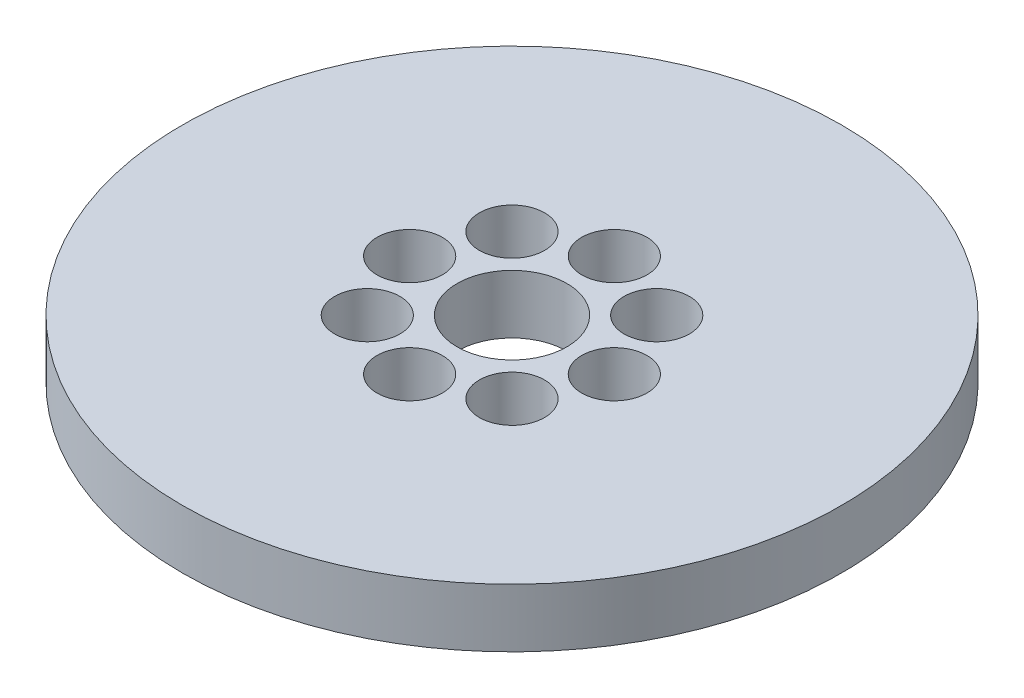
ISO-10303-21;
HEADER;
FILE_DESCRIPTION(('STEP AP214'),'2;1');
FILE_NAME('part.step','',(''),(''),'','','');
FILE_SCHEMA(('AUTOMOTIVE_DESIGN { 1 0 10303 214 1 1 1 1 }'));
ENDSEC;
DATA;
#1=APPLICATION_CONTEXT('core data for automotive mechanical design processes');
#2=APPLICATION_PROTOCOL_DEFINITION('international standard','automotive_design',2000,#1);
#3=PRODUCT_CONTEXT('',#1,'mechanical');
#4=PRODUCT('Part','Part','',(#3));
#5=PRODUCT_RELATED_PRODUCT_CATEGORY('part','',(#4));
#6=PRODUCT_DEFINITION_FORMATION('','',#4);
#7=PRODUCT_DEFINITION_CONTEXT('part definition',#1,'design');
#8=PRODUCT_DEFINITION('design','',#6,#7);
#9=PRODUCT_DEFINITION_SHAPE('','',#8);
#10=(LENGTH_UNIT() NAMED_UNIT(*) SI_UNIT(.MILLI.,.METRE.));
#11=(NAMED_UNIT(*) PLANE_ANGLE_UNIT() SI_UNIT($,.RADIAN.));
#12=(NAMED_UNIT(*) SI_UNIT($,.STERADIAN.) SOLID_ANGLE_UNIT());
#13=UNCERTAINTY_MEASURE_WITH_UNIT(LENGTH_MEASURE(1.E-05),#10,'distance_accuracy_value','');
#14=(GEOMETRIC_REPRESENTATION_CONTEXT(3) GLOBAL_UNCERTAINTY_ASSIGNED_CONTEXT((#13)) GLOBAL_UNIT_ASSIGNED_CONTEXT((#10,
#11,#12)) REPRESENTATION_CONTEXT('',''));
#15=CARTESIAN_POINT('',(0.,0.,0.));
#16=DIRECTION('',(0.,0.,1.));
#17=DIRECTION('',(1.,0.,0.));
#18=AXIS2_PLACEMENT_3D('',#15,#16,#17);
#19=CARTESIAN_POINT('',(0.,8.,0.));
#20=DIRECTION('',(0.,-1.,0.));
#21=DIRECTION('',(0.,0.,-1.));
#22=AXIS2_PLACEMENT_3D('',#19,#20,#21);
#23=CYLINDRICAL_SURFACE('',#22,45.);
#24=CARTESIAN_POINT('',(0.,8.,0.));
#25=DIRECTION('',(0.,1.,0.));
#26=DIRECTION('',(0.,0.,1.));
#27=AXIS2_PLACEMENT_3D('',#24,#25,#26);
#28=CIRCLE('',#27,45.);
#29=CARTESIAN_POINT('',(0.,8.,45.));
#30=VERTEX_POINT('',#29);
#31=EDGE_CURVE('E10',#30,#30,#28,.T.);
#32=ORIENTED_EDGE('',*,*,#31,.F.);
#33=EDGE_LOOP('',(#32));
#34=FACE_BOUND('',#33,.T.);
#35=CARTESIAN_POINT('',(0.,0.,0.));
#36=DIRECTION('',(0.,1.,0.));
#37=DIRECTION('',(0.,0.,1.));
#38=AXIS2_PLACEMENT_3D('',#35,#36,#37);
#39=CIRCLE('',#38,45.);
#40=CARTESIAN_POINT('',(0.,0.,45.));
#41=VERTEX_POINT('',#40);
#42=EDGE_CURVE('E37',#41,#41,#39,.T.);
#43=ORIENTED_EDGE('',*,*,#42,.T.);
#44=EDGE_LOOP('',(#43));
#45=FACE_BOUND('',#44,.T.);
#46=ADVANCED_FACE('F40',(#34,#45),#23,.T.);
#47=CARTESIAN_POINT('',(0.,8.,0.));
#48=DIRECTION('',(0.,1.,0.));
#49=DIRECTION('',(0.,0.,1.));
#50=AXIS2_PLACEMENT_3D('',#47,#48,#49);
#51=PLANE('',#50);
#52=CARTESIAN_POINT('',(0.,8.,13.9738359424887));
#53=DIRECTION('',(0.,1.,0.));
#54=DIRECTION('',(1.,0.,0.));
#55=AXIS2_PLACEMENT_3D('',#52,#53,#54);
#56=CIRCLE('',#55,4.45452999199533);
#57=CARTESIAN_POINT('',(4.45452999199538,8.,13.9738359424887));
#58=VERTEX_POINT('',#57);
#59=EDGE_CURVE('E88',#58,#58,#56,.T.);
#60=ORIENTED_EDGE('',*,*,#59,.F.);
#61=EDGE_LOOP('',(#60));
#62=FACE_BOUND('',#61,.T.);
#63=CARTESIAN_POINT('',(9.88099415412215,8.,9.88099415412205));
#64=DIRECTION('',(0.,1.,0.));
#65=DIRECTION('',(0.707106781186544,0.,-0.707106781186551));
#66=AXIS2_PLACEMENT_3D('',#63,#64,#65);
#67=CIRCLE('',#66,4.45452999199533);
#68=CARTESIAN_POINT('',(13.0308225184609,8.,6.73116578978328));
#69=VERTEX_POINT('',#68);
#70=EDGE_CURVE('E79',#69,#69,#67,.T.);
#71=ORIENTED_EDGE('',*,*,#70,.F.);
#72=EDGE_LOOP('',(#71));
#73=FACE_BOUND('',#72,.T.);
#74=CARTESIAN_POINT('',(13.9738359424887,8.,0.));
#75=DIRECTION('',(0.,1.,0.));
#76=DIRECTION('',(0.,0.,-1.));
#77=AXIS2_PLACEMENT_3D('',#74,#75,#76);
#78=CIRCLE('',#77,4.45452999199533);
#79=CARTESIAN_POINT('',(13.9738359424887,8.,-4.45452999199533));
#80=VERTEX_POINT('',#79);
#81=EDGE_CURVE('E74',#80,#80,#78,.T.);
#82=ORIENTED_EDGE('',*,*,#81,.F.);
#83=EDGE_LOOP('',(#82));
#84=FACE_BOUND('',#83,.T.);
#85=CARTESIAN_POINT('',(9.88099415412202,8.,-9.88099415412219));
#86=DIRECTION('',(0.,1.,0.));
#87=DIRECTION('',(-0.707106781186554,0.,-0.707106781186541));
#88=AXIS2_PLACEMENT_3D('',#85,#86,#87);
#89=CIRCLE('',#88,4.45452999199533);
#90=CARTESIAN_POINT('',(6.73116578978324,8.,-13.0308225184609));
#91=VERTEX_POINT('',#90);
#92=EDGE_CURVE('E70',#91,#91,#89,.T.);
#93=ORIENTED_EDGE('',*,*,#92,.F.);
#94=EDGE_LOOP('',(#93));
#95=FACE_BOUND('',#94,.T.);
#96=CARTESIAN_POINT('',(-1.46368162275765E-13,8.,-13.9738359424887));
#97=DIRECTION('',(0.,1.,0.));
#98=DIRECTION('',(-1.,0.,0.));
#99=AXIS2_PLACEMENT_3D('',#96,#97,#98);
#100=CIRCLE('',#99,4.45452999199533);
#101=CARTESIAN_POINT('',(-4.45452999199547,8.,-13.9738359424887));
#102=VERTEX_POINT('',#101);
#103=EDGE_CURVE('E100',#102,#102,#100,.T.);
#104=ORIENTED_EDGE('',*,*,#103,.F.);
#105=EDGE_LOOP('',(#104));
#106=FACE_BOUND('',#105,.T.);
#107=CARTESIAN_POINT('',(-9.88099415412222,8.,-9.88099415412198));
#108=DIRECTION('',(0.,1.,0.));
#109=DIRECTION('',(-0.707106781186539,0.,0.707106781186556));
#110=AXIS2_PLACEMENT_3D('',#107,#108,#109);
#111=CIRCLE('',#110,4.45452999199533);
#112=CARTESIAN_POINT('',(-13.0308225184609,8.,-6.73116578978319));
#113=VERTEX_POINT('',#112);
#114=EDGE_CURVE('E93',#113,#113,#111,.T.);
#115=ORIENTED_EDGE('',*,*,#114,.F.);
#116=EDGE_LOOP('',(#115));
#117=FACE_BOUND('',#116,.T.);
#118=CARTESIAN_POINT('',(-9.88099415412209,8.,9.88099415412212));
#119=DIRECTION('',(0.,1.,0.));
#120=DIRECTION('',(0.707106781186549,0.,0.707106781186546));
#121=AXIS2_PLACEMENT_3D('',#118,#119,#120);
#122=CIRCLE('',#121,4.45452999199533);
#123=CARTESIAN_POINT('',(-6.73116578978333,8.,13.0308225184609));
#124=VERTEX_POINT('',#123);
#125=EDGE_CURVE('E61',#124,#124,#122,.T.);
#126=ORIENTED_EDGE('',*,*,#125,.F.);
#127=EDGE_LOOP('',(#126));
#128=FACE_BOUND('',#127,.T.);
#129=CARTESIAN_POINT('',(-13.9738359424887,8.,0.));
#130=DIRECTION('',(0.,1.,0.));
#131=DIRECTION('',(0.,0.,1.));
#132=AXIS2_PLACEMENT_3D('',#129,#130,#131);
#133=CIRCLE('',#132,4.45452999199533);
#134=CARTESIAN_POINT('',(-13.9738359424887,8.,4.45452999199533));
#135=VERTEX_POINT('',#134);
#136=EDGE_CURVE('E54',#135,#135,#133,.T.);
#137=ORIENTED_EDGE('',*,*,#136,.F.);
#138=EDGE_LOOP('',(#137));
#139=FACE_BOUND('',#138,.T.);
#140=CARTESIAN_POINT('',(0.,8.,0.));
#141=DIRECTION('',(0.,1.,0.));
#142=DIRECTION('',(0.,0.,1.));
#143=AXIS2_PLACEMENT_3D('',#140,#141,#142);
#144=CIRCLE('',#143,7.5);
#145=CARTESIAN_POINT('',(0.,8.,7.5));
#146=VERTEX_POINT('',#145);
#147=EDGE_CURVE('E50',#146,#146,#144,.T.);
#148=ORIENTED_EDGE('',*,*,#147,.F.);
#149=EDGE_LOOP('',(#148));
#150=FACE_BOUND('',#149,.T.);
#151=ORIENTED_EDGE('',*,*,#31,.T.);
#152=EDGE_LOOP('',(#151));
#153=FACE_BOUND('',#152,.T.);
#154=ADVANCED_FACE('F115',(#62,#73,#84,#95,#106,#117,#128,#139,#150,#153),#51,.T.);
#155=CARTESIAN_POINT('',(0.,0.,0.));
#156=DIRECTION('',(0.,1.,0.));
#157=DIRECTION('',(0.,0.,1.));
#158=AXIS2_PLACEMENT_3D('',#155,#156,#157);
#159=PLANE('',#158);
#160=CARTESIAN_POINT('',(0.,0.,0.));
#161=DIRECTION('',(0.,1.,0.));
#162=DIRECTION('',(0.,0.,1.));
#163=AXIS2_PLACEMENT_3D('',#160,#161,#162);
#164=CIRCLE('',#163,7.5);
#165=CARTESIAN_POINT('',(0.,0.,7.5));
#166=VERTEX_POINT('',#165);
#167=EDGE_CURVE('E47',#166,#166,#164,.T.);
#168=ORIENTED_EDGE('',*,*,#167,.T.);
#169=EDGE_LOOP('',(#168));
#170=FACE_BOUND('',#169,.T.);
#171=ORIENTED_EDGE('',*,*,#42,.F.);
#172=EDGE_LOOP('',(#171));
#173=FACE_BOUND('',#172,.T.);
#174=ADVANCED_FACE('F113',(#170,#173),#159,.F.);
#175=CARTESIAN_POINT('',(0.,8.,0.));
#176=DIRECTION('',(0.,-1.,0.));
#177=DIRECTION('',(0.,0.,-1.));
#178=AXIS2_PLACEMENT_3D('',#175,#176,#177);
#179=CYLINDRICAL_SURFACE('',#178,7.5);
#180=ORIENTED_EDGE('',*,*,#147,.T.);
#181=EDGE_LOOP('',(#180));
#182=FACE_BOUND('',#181,.T.);
#183=ORIENTED_EDGE('',*,*,#167,.F.);
#184=EDGE_LOOP('',(#183));
#185=FACE_BOUND('',#184,.T.);
#186=ADVANCED_FACE('F127',(#182,#185),#179,.F.);
#187=CARTESIAN_POINT('',(-13.9738359424887,0.949852777209527,0.));
#188=DIRECTION('',(0.,1.,0.));
#189=DIRECTION('',(0.,0.,1.));
#190=AXIS2_PLACEMENT_3D('',#187,#188,#189);
#191=CYLINDRICAL_SURFACE('',#190,4.45452999199533);
#192=CARTESIAN_POINT('',(-13.9738359424887,0.949852777209527,0.));
#193=DIRECTION('',(0.,1.,0.));
#194=DIRECTION('',(0.,0.,1.));
#195=AXIS2_PLACEMENT_3D('',#192,#193,#194);
#196=CIRCLE('',#195,4.45452999199533);
#197=CARTESIAN_POINT('',(-13.9738359424887,0.949852777209527,4.45452999199533));
#198=VERTEX_POINT('',#197);
#199=EDGE_CURVE('E55',#198,#198,#196,.T.);
#200=ORIENTED_EDGE('',*,*,#199,.F.);
#201=EDGE_LOOP('',(#200));
#202=FACE_BOUND('',#201,.T.);
#203=ORIENTED_EDGE('',*,*,#136,.T.);
#204=EDGE_LOOP('',(#203));
#205=FACE_BOUND('',#204,.T.);
#206=ADVANCED_FACE('F129',(#202,#205),#191,.F.);
#207=CARTESIAN_POINT('',(-13.9738359424887,0.949852777209527,0.));
#208=DIRECTION('',(0.,1.,0.));
#209=DIRECTION('',(0.,0.,1.));
#210=AXIS2_PLACEMENT_3D('',#207,#208,#209);
#211=PLANE('',#210);
#212=ORIENTED_EDGE('',*,*,#199,.T.);
#213=EDGE_LOOP('',(#212));
#214=FACE_BOUND('',#213,.T.);
#215=ADVANCED_FACE('F157',(#214),#211,.T.);
#216=CARTESIAN_POINT('',(-9.88099415412209,0.949852777209527,9.88099415412212));
#217=DIRECTION('',(0.,1.,0.));
#218=DIRECTION('',(0.,0.,1.));
#219=AXIS2_PLACEMENT_3D('',#216,#217,#218);
#220=CYLINDRICAL_SURFACE('',#219,4.45452999199533);
#221=CARTESIAN_POINT('',(-9.88099415412209,0.949852777209527,9.88099415412212));
#222=DIRECTION('',(0.,1.,0.));
#223=DIRECTION('',(0.707106781186549,0.,0.707106781186546));
#224=AXIS2_PLACEMENT_3D('',#221,#222,#223);
#225=CIRCLE('',#224,4.45452999199533);
#226=CARTESIAN_POINT('',(-6.73116578978333,0.949852777209527,13.0308225184609));
#227=VERTEX_POINT('',#226);
#228=EDGE_CURVE('E59',#227,#227,#225,.T.);
#229=ORIENTED_EDGE('',*,*,#228,.F.);
#230=EDGE_LOOP('',(#229));
#231=FACE_BOUND('',#230,.T.);
#232=ORIENTED_EDGE('',*,*,#125,.T.);
#233=EDGE_LOOP('',(#232));
#234=FACE_BOUND('',#233,.T.);
#235=ADVANCED_FACE('F170',(#231,#234),#220,.F.);
#236=CARTESIAN_POINT('',(-9.88099415412209,0.949852777209527,9.88099415412212));
#237=DIRECTION('',(0.,1.,0.));
#238=DIRECTION('',(0.707106781186549,0.,0.707106781186546));
#239=AXIS2_PLACEMENT_3D('',#236,#237,#238);
#240=PLANE('',#239);
#241=ORIENTED_EDGE('',*,*,#228,.T.);
#242=EDGE_LOOP('',(#241));
#243=FACE_BOUND('',#242,.T.);
#244=ADVANCED_FACE('F182',(#243),#240,.T.);
#245=CARTESIAN_POINT('',(-9.88099415412222,0.949852777209527,-9.88099415412198));
#246=DIRECTION('',(0.,1.,0.));
#247=DIRECTION('',(0.,0.,1.));
#248=AXIS2_PLACEMENT_3D('',#245,#246,#247);
#249=CYLINDRICAL_SURFACE('',#248,4.45452999199533);
#250=CARTESIAN_POINT('',(-9.88099415412222,0.949852777209527,-9.88099415412198));
#251=DIRECTION('',(0.,1.,0.));
#252=DIRECTION('',(-0.707106781186539,0.,0.707106781186556));
#253=AXIS2_PLACEMENT_3D('',#250,#251,#252);
#254=CIRCLE('',#253,4.45452999199533);
#255=CARTESIAN_POINT('',(-13.0308225184609,0.949852777209527,-6.73116578978319));
#256=VERTEX_POINT('',#255);
#257=EDGE_CURVE('E94',#256,#256,#254,.T.);
#258=ORIENTED_EDGE('',*,*,#257,.F.);
#259=EDGE_LOOP('',(#258));
#260=FACE_BOUND('',#259,.T.);
#261=ORIENTED_EDGE('',*,*,#114,.T.);
#262=EDGE_LOOP('',(#261));
#263=FACE_BOUND('',#262,.T.);
#264=ADVANCED_FACE('F189',(#260,#263),#249,.F.);
#265=CARTESIAN_POINT('',(-9.88099415412222,0.949852777209527,-9.88099415412198));
#266=DIRECTION('',(0.,1.,0.));
#267=DIRECTION('',(-0.707106781186539,0.,0.707106781186556));
#268=AXIS2_PLACEMENT_3D('',#265,#266,#267);
#269=PLANE('',#268);
#270=ORIENTED_EDGE('',*,*,#257,.T.);
#271=EDGE_LOOP('',(#270));
#272=FACE_BOUND('',#271,.T.);
#273=ADVANCED_FACE('F107',(#272),#269,.T.);
#274=CARTESIAN_POINT('',(-1.46368162275765E-13,0.949852777209527,-13.9738359424887));
#275=DIRECTION('',(0.,1.,0.));
#276=DIRECTION('',(0.,0.,1.));
#277=AXIS2_PLACEMENT_3D('',#274,#275,#276);
#278=CYLINDRICAL_SURFACE('',#277,4.45452999199533);
#279=CARTESIAN_POINT('',(-1.46368162275765E-13,0.949852777209527,-13.9738359424887));
#280=DIRECTION('',(0.,1.,0.));
#281=DIRECTION('',(-1.,0.,0.));
#282=AXIS2_PLACEMENT_3D('',#279,#280,#281);
#283=CIRCLE('',#282,4.45452999199533);
#284=CARTESIAN_POINT('',(-4.45452999199547,0.949852777209527,-13.9738359424887));
#285=VERTEX_POINT('',#284);
#286=EDGE_CURVE('E72',#285,#285,#283,.T.);
#287=ORIENTED_EDGE('',*,*,#286,.F.);
#288=EDGE_LOOP('',(#287));
#289=FACE_BOUND('',#288,.T.);
#290=ORIENTED_EDGE('',*,*,#103,.T.);
#291=EDGE_LOOP('',(#290));
#292=FACE_BOUND('',#291,.T.);
#293=ADVANCED_FACE('F104',(#289,#292),#278,.F.);
#294=CARTESIAN_POINT('',(-1.46368162275765E-13,0.949852777209527,-13.9738359424887));
#295=DIRECTION('',(0.,1.,0.));
#296=DIRECTION('',(-1.,0.,0.));
#297=AXIS2_PLACEMENT_3D('',#294,#295,#296);
#298=PLANE('',#297);
#299=ORIENTED_EDGE('',*,*,#286,.T.);
#300=EDGE_LOOP('',(#299));
#301=FACE_BOUND('',#300,.T.);
#302=ADVANCED_FACE('F103',(#301),#298,.T.);
#303=CARTESIAN_POINT('',(9.88099415412202,0.949852777209527,-9.88099415412219));
#304=DIRECTION('',(0.,1.,0.));
#305=DIRECTION('',(0.,0.,1.));
#306=AXIS2_PLACEMENT_3D('',#303,#304,#305);
#307=CYLINDRICAL_SURFACE('',#306,4.45452999199533);
#308=CARTESIAN_POINT('',(9.88099415412202,0.949852777209527,-9.88099415412219));
#309=DIRECTION('',(0.,1.,0.));
#310=DIRECTION('',(-0.707106781186554,0.,-0.707106781186541));
#311=AXIS2_PLACEMENT_3D('',#308,#309,#310);
#312=CIRCLE('',#311,4.45452999199533);
#313=CARTESIAN_POINT('',(6.73116578978324,0.949852777209527,-13.0308225184609));
#314=VERTEX_POINT('',#313);
#315=EDGE_CURVE('E69',#314,#314,#312,.T.);
#316=ORIENTED_EDGE('',*,*,#315,.F.);
#317=EDGE_LOOP('',(#316));
#318=FACE_BOUND('',#317,.T.);
#319=ORIENTED_EDGE('',*,*,#92,.T.);
#320=EDGE_LOOP('',(#319));
#321=FACE_BOUND('',#320,.T.);
#322=ADVANCED_FACE('F219',(#318,#321),#307,.F.);
#323=CARTESIAN_POINT('',(9.88099415412202,0.949852777209527,-9.88099415412219));
#324=DIRECTION('',(0.,1.,0.));
#325=DIRECTION('',(-0.707106781186554,0.,-0.707106781186541));
#326=AXIS2_PLACEMENT_3D('',#323,#324,#325);
#327=PLANE('',#326);
#328=ORIENTED_EDGE('',*,*,#315,.T.);
#329=EDGE_LOOP('',(#328));
#330=FACE_BOUND('',#329,.T.);
#331=ADVANCED_FACE('F227',(#330),#327,.T.);
#332=CARTESIAN_POINT('',(13.9738359424887,0.949852777209527,0.));
#333=DIRECTION('',(0.,1.,0.));
#334=DIRECTION('',(0.,0.,1.));
#335=AXIS2_PLACEMENT_3D('',#332,#333,#334);
#336=CYLINDRICAL_SURFACE('',#335,4.45452999199533);
#337=CARTESIAN_POINT('',(13.9738359424887,0.949852777209527,0.));
#338=DIRECTION('',(0.,1.,0.));
#339=DIRECTION('',(0.,0.,-1.));
#340=AXIS2_PLACEMENT_3D('',#337,#338,#339);
#341=CIRCLE('',#340,4.45452999199533);
#342=CARTESIAN_POINT('',(13.9738359424887,0.949852777209527,-4.45452999199533));
#343=VERTEX_POINT('',#342);
#344=EDGE_CURVE('E80',#343,#343,#341,.T.);
#345=ORIENTED_EDGE('',*,*,#344,.F.);
#346=EDGE_LOOP('',(#345));
#347=FACE_BOUND('',#346,.T.);
#348=ORIENTED_EDGE('',*,*,#81,.T.);
#349=EDGE_LOOP('',(#348));
#350=FACE_BOUND('',#349,.T.);
#351=ADVANCED_FACE('F240',(#347,#350),#336,.F.);
#352=CARTESIAN_POINT('',(13.9738359424887,0.949852777209527,0.));
#353=DIRECTION('',(0.,1.,0.));
#354=DIRECTION('',(0.,0.,-1.));
#355=AXIS2_PLACEMENT_3D('',#352,#353,#354);
#356=PLANE('',#355);
#357=ORIENTED_EDGE('',*,*,#344,.T.);
#358=EDGE_LOOP('',(#357));
#359=FACE_BOUND('',#358,.T.);
#360=ADVANCED_FACE('F246',(#359),#356,.T.);
#361=CARTESIAN_POINT('',(9.88099415412215,0.949852777209527,9.88099415412205));
#362=DIRECTION('',(0.,1.,0.));
#363=DIRECTION('',(0.,0.,1.));
#364=AXIS2_PLACEMENT_3D('',#361,#362,#363);
#365=CYLINDRICAL_SURFACE('',#364,4.45452999199533);
#366=CARTESIAN_POINT('',(9.88099415412215,0.949852777209527,9.88099415412205));
#367=DIRECTION('',(0.,1.,0.));
#368=DIRECTION('',(0.707106781186544,0.,-0.707106781186551));
#369=AXIS2_PLACEMENT_3D('',#366,#367,#368);
#370=CIRCLE('',#369,4.45452999199533);
#371=CARTESIAN_POINT('',(13.0308225184609,0.949852777209527,6.73116578978328));
#372=VERTEX_POINT('',#371);
#373=EDGE_CURVE('E82',#372,#372,#370,.T.);
#374=ORIENTED_EDGE('',*,*,#373,.F.);
#375=EDGE_LOOP('',(#374));
#376=FACE_BOUND('',#375,.T.);
#377=ORIENTED_EDGE('',*,*,#70,.T.);
#378=EDGE_LOOP('',(#377));
#379=FACE_BOUND('',#378,.T.);
#380=ADVANCED_FACE('F254',(#376,#379),#365,.F.);
#381=CARTESIAN_POINT('',(9.88099415412215,0.949852777209527,9.88099415412205));
#382=DIRECTION('',(0.,1.,0.));
#383=DIRECTION('',(0.707106781186544,0.,-0.707106781186551));
#384=AXIS2_PLACEMENT_3D('',#381,#382,#383);
#385=PLANE('',#384);
#386=ORIENTED_EDGE('',*,*,#373,.T.);
#387=EDGE_LOOP('',(#386));
#388=FACE_BOUND('',#387,.T.);
#389=ADVANCED_FACE('F262',(#388),#385,.T.);
#390=CARTESIAN_POINT('',(0.,0.949852777209527,13.9738359424887));
#391=DIRECTION('',(0.,1.,0.));
#392=DIRECTION('',(0.,0.,1.));
#393=AXIS2_PLACEMENT_3D('',#390,#391,#392);
#394=CYLINDRICAL_SURFACE('',#393,4.45452999199533);
#395=CARTESIAN_POINT('',(0.,0.949852777209527,13.9738359424887));
#396=DIRECTION('',(0.,1.,0.));
#397=DIRECTION('',(1.,0.,0.));
#398=AXIS2_PLACEMENT_3D('',#395,#396,#397);
#399=CIRCLE('',#398,4.45452999199533);
#400=CARTESIAN_POINT('',(4.45452999199538,0.949852777209527,13.9738359424887));
#401=VERTEX_POINT('',#400);
#402=EDGE_CURVE('E63',#401,#401,#399,.T.);
#403=ORIENTED_EDGE('',*,*,#402,.F.);
#404=EDGE_LOOP('',(#403));
#405=FACE_BOUND('',#404,.T.);
#406=ORIENTED_EDGE('',*,*,#59,.T.);
#407=EDGE_LOOP('',(#406));
#408=FACE_BOUND('',#407,.T.);
#409=ADVANCED_FACE('F272',(#405,#408),#394,.F.);
#410=CARTESIAN_POINT('',(0.,0.949852777209527,13.9738359424887));
#411=DIRECTION('',(0.,1.,0.));
#412=DIRECTION('',(1.,0.,0.));
#413=AXIS2_PLACEMENT_3D('',#410,#411,#412);
#414=PLANE('',#413);
#415=ORIENTED_EDGE('',*,*,#402,.T.);
#416=EDGE_LOOP('',(#415));
#417=FACE_BOUND('',#416,.T.);
#418=ADVANCED_FACE('F285',(#417),#414,.T.);
#419=CLOSED_SHELL('',(#46,#154,#174,#186,#206,#215,#235,#244,#264,#273,#293,#302,#322,#331,#351,
#360,#380,#389,#409,#418));
#420=MANIFOLD_SOLID_BREP('B2',#419);
#421=ADVANCED_BREP_SHAPE_REPRESENTATION('',(#18,#420),#14);
#422=SHAPE_DEFINITION_REPRESENTATION(#9,#421);
ENDSEC;
END-ISO-10303-21;
